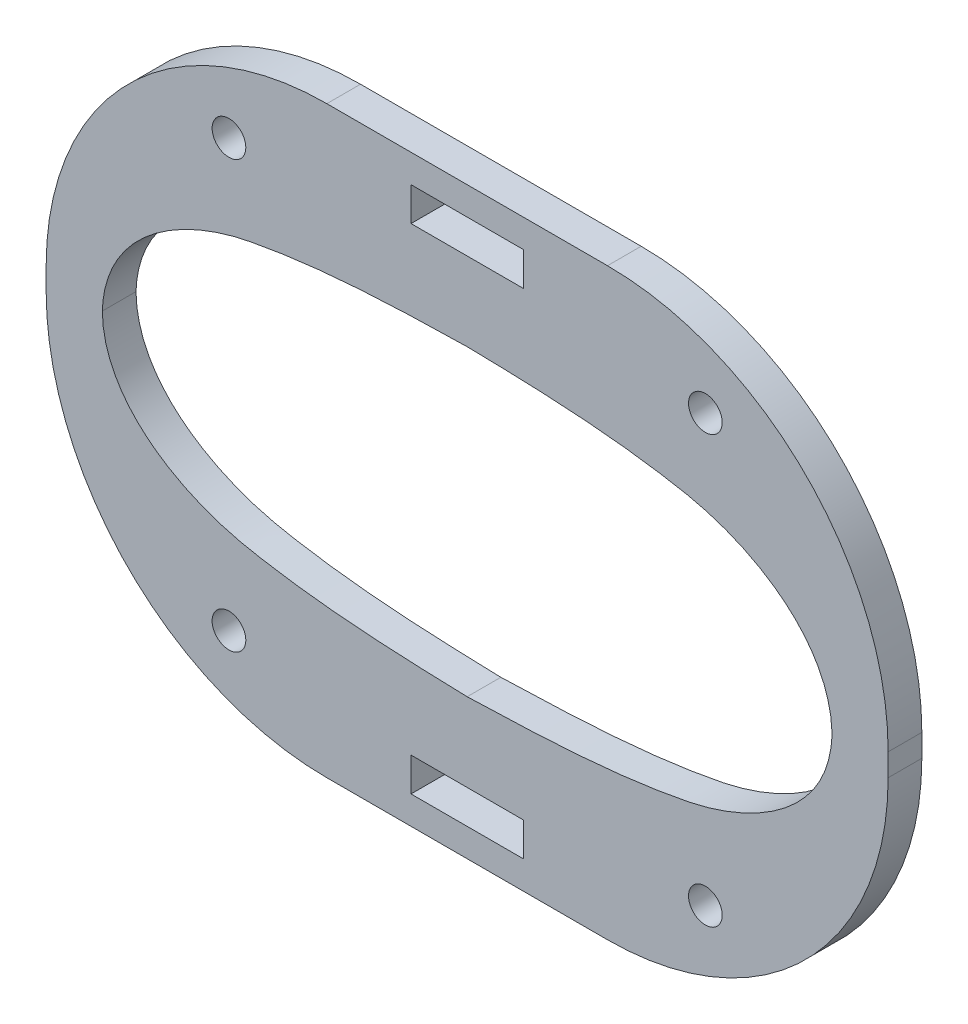
ISO-10303-21;
HEADER;
FILE_DESCRIPTION(('STEP AP214'),'2;1');
FILE_NAME('part.step','',(''),(''),'','','');
FILE_SCHEMA(('AUTOMOTIVE_DESIGN { 1 0 10303 214 1 1 1 1 }'));
ENDSEC;
DATA;
#1=APPLICATION_CONTEXT('core data for automotive mechanical design processes');
#2=APPLICATION_PROTOCOL_DEFINITION('international standard','automotive_design',2000,#1);
#3=PRODUCT_CONTEXT('',#1,'mechanical');
#4=PRODUCT('Part','Part','',(#3));
#5=PRODUCT_RELATED_PRODUCT_CATEGORY('part','',(#4));
#6=PRODUCT_DEFINITION_FORMATION('','',#4);
#7=PRODUCT_DEFINITION_CONTEXT('part definition',#1,'design');
#8=PRODUCT_DEFINITION('design','',#6,#7);
#9=PRODUCT_DEFINITION_SHAPE('','',#8);
#10=(LENGTH_UNIT() NAMED_UNIT(*) SI_UNIT(.MILLI.,.METRE.));
#11=(NAMED_UNIT(*) PLANE_ANGLE_UNIT() SI_UNIT($,.RADIAN.));
#12=(NAMED_UNIT(*) SI_UNIT($,.STERADIAN.) SOLID_ANGLE_UNIT());
#13=UNCERTAINTY_MEASURE_WITH_UNIT(LENGTH_MEASURE(1.E-05),#10,'distance_accuracy_value','');
#14=(GEOMETRIC_REPRESENTATION_CONTEXT(3) GLOBAL_UNCERTAINTY_ASSIGNED_CONTEXT((#13)) GLOBAL_UNIT_ASSIGNED_CONTEXT((#10,
#11,#12)) REPRESENTATION_CONTEXT('',''));
#15=CARTESIAN_POINT('',(0.,0.,0.));
#16=DIRECTION('',(0.,0.,1.));
#17=DIRECTION('',(1.,0.,0.));
#18=AXIS2_PLACEMENT_3D('',#15,#16,#17);
#19=CARTESIAN_POINT('',(-12.5,-0.999999999999991,3.));
#20=DIRECTION('',(0.,0.,-1.));
#21=DIRECTION('',(-1.,0.,0.));
#22=AXIS2_PLACEMENT_3D('',#19,#20,#21);
#23=PLANE('',#22);
#24=DIRECTION('',(0.,1.,0.));
#25=VECTOR('',#24,1.);
#26=CARTESIAN_POINT('',(5.,23.5,3.));
#27=LINE('',#26,#25);
#28=CARTESIAN_POINT('',(5.,20.5,3.));
#29=VERTEX_POINT('',#28);
#30=CARTESIAN_POINT('',(5.,23.5,3.));
#31=VERTEX_POINT('',#30);
#32=EDGE_CURVE('E497',#29,#31,#27,.T.);
#33=ORIENTED_EDGE('',*,*,#32,.F.);
#34=DIRECTION('',(1.,0.,0.));
#35=VECTOR('',#34,1.);
#36=CARTESIAN_POINT('',(5.,20.5,3.));
#37=LINE('',#36,#35);
#38=CARTESIAN_POINT('',(-5.,20.5,3.));
#39=VERTEX_POINT('',#38);
#40=EDGE_CURVE('E504',#39,#29,#37,.T.);
#41=ORIENTED_EDGE('',*,*,#40,.F.);
#42=DIRECTION('',(0.,-1.,0.));
#43=VECTOR('',#42,1.);
#44=CARTESIAN_POINT('',(-5.,23.5,3.));
#45=LINE('',#44,#43);
#46=CARTESIAN_POINT('',(-5.,23.5,3.));
#47=VERTEX_POINT('',#46);
#48=EDGE_CURVE('E501',#47,#39,#45,.T.);
#49=ORIENTED_EDGE('',*,*,#48,.F.);
#50=DIRECTION('',(-1.,0.,0.));
#51=VECTOR('',#50,1.);
#52=CARTESIAN_POINT('',(5.,23.5,3.));
#53=LINE('',#52,#51);
#54=EDGE_CURVE('E499',#31,#47,#53,.T.);
#55=ORIENTED_EDGE('',*,*,#54,.F.);
#56=EDGE_LOOP('',(#33,#41,#49,#55));
#57=FACE_BOUND('',#56,.T.);
#58=CARTESIAN_POINT('',(-12.5,-0.999999999999991,3.));
#59=DIRECTION('',(0.,0.,1.));
#60=DIRECTION('',(-1.,0.,0.));
#61=AXIS2_PLACEMENT_3D('',#58,#59,#60);
#62=CIRCLE('',#61,25.);
#63=CARTESIAN_POINT('',(-37.5,-0.999999999999985,3.));
#64=VERTEX_POINT('',#63);
#65=CARTESIAN_POINT('',(-12.5,-26.,3.));
#66=VERTEX_POINT('',#65);
#67=EDGE_CURVE('E318',#64,#66,#62,.T.);
#68=ORIENTED_EDGE('',*,*,#67,.T.);
#69=DIRECTION('',(1.,0.,0.));
#70=VECTOR('',#69,1.);
#71=CARTESIAN_POINT('',(12.5,-26.,3.));
#72=LINE('',#71,#70);
#73=CARTESIAN_POINT('',(12.5,-26.,3.));
#74=VERTEX_POINT('',#73);
#75=EDGE_CURVE('E344',#66,#74,#72,.T.);
#76=ORIENTED_EDGE('',*,*,#75,.T.);
#77=CARTESIAN_POINT('',(12.5,-0.999999999999991,3.));
#78=DIRECTION('',(0.,0.,1.));
#79=DIRECTION('',(-1.,0.,0.));
#80=AXIS2_PLACEMENT_3D('',#77,#78,#79);
#81=CIRCLE('',#80,25.);
#82=CARTESIAN_POINT('',(37.5,-0.999999999999988,3.));
#83=VERTEX_POINT('',#82);
#84=EDGE_CURVE('E300',#74,#83,#81,.T.);
#85=ORIENTED_EDGE('',*,*,#84,.T.);
#86=DIRECTION('',(0.,1.,0.));
#87=VECTOR('',#86,1.);
#88=CARTESIAN_POINT('',(37.5,0.999999999999985,3.));
#89=LINE('',#88,#87);
#90=CARTESIAN_POINT('',(37.5,0.999999999999985,3.));
#91=VERTEX_POINT('',#90);
#92=EDGE_CURVE('E337',#83,#91,#89,.T.);
#93=ORIENTED_EDGE('',*,*,#92,.T.);
#94=CARTESIAN_POINT('',(12.5,0.999999999999985,3.));
#95=DIRECTION('',(0.,0.,1.));
#96=DIRECTION('',(-1.,0.,0.));
#97=AXIS2_PLACEMENT_3D('',#94,#95,#96);
#98=CIRCLE('',#97,25.);
#99=CARTESIAN_POINT('',(12.5,26.,3.));
#100=VERTEX_POINT('',#99);
#101=EDGE_CURVE('E340',#91,#100,#98,.T.);
#102=ORIENTED_EDGE('',*,*,#101,.T.);
#103=DIRECTION('',(-1.,0.,0.));
#104=VECTOR('',#103,1.);
#105=CARTESIAN_POINT('',(12.5,26.,3.));
#106=LINE('',#105,#104);
#107=CARTESIAN_POINT('',(-12.5,26.,3.));
#108=VERTEX_POINT('',#107);
#109=EDGE_CURVE('E342',#100,#108,#106,.T.);
#110=ORIENTED_EDGE('',*,*,#109,.T.);
#111=CARTESIAN_POINT('',(-12.5,0.999999999999985,3.));
#112=DIRECTION('',(0.,0.,1.));
#113=DIRECTION('',(1.,0.,0.));
#114=AXIS2_PLACEMENT_3D('',#111,#112,#113);
#115=CIRCLE('',#114,25.);
#116=CARTESIAN_POINT('',(-37.5,0.999999999999988,3.));
#117=VERTEX_POINT('',#116);
#118=EDGE_CURVE('E349',#108,#117,#115,.T.);
#119=ORIENTED_EDGE('',*,*,#118,.T.);
#120=DIRECTION('',(0.,-1.,0.));
#121=VECTOR('',#120,1.);
#122=CARTESIAN_POINT('',(-37.5,0.999999999999985,3.));
#123=LINE('',#122,#121);
#124=EDGE_CURVE('E323',#117,#64,#123,.T.);
#125=ORIENTED_EDGE('',*,*,#124,.T.);
#126=EDGE_LOOP('',(#68,#76,#85,#93,#102,#110,#119,#125));
#127=FACE_BOUND('',#126,.T.);
#128=DIRECTION('',(0.,-1.,0.));
#129=VECTOR('',#128,1.);
#130=CARTESIAN_POINT('',(-5.,-23.5,3.));
#131=LINE('',#130,#129);
#132=CARTESIAN_POINT('',(-5.,-20.5,3.));
#133=VERTEX_POINT('',#132);
#134=CARTESIAN_POINT('',(-5.,-23.5,3.));
#135=VERTEX_POINT('',#134);
#136=EDGE_CURVE('E377',#133,#135,#131,.T.);
#137=ORIENTED_EDGE('',*,*,#136,.F.);
#138=DIRECTION('',(-1.,0.,0.));
#139=VECTOR('',#138,1.);
#140=CARTESIAN_POINT('',(5.,-20.5,3.));
#141=LINE('',#140,#139);
#142=CARTESIAN_POINT('',(5.,-20.5,3.));
#143=VERTEX_POINT('',#142);
#144=EDGE_CURVE('E379',#143,#133,#141,.T.);
#145=ORIENTED_EDGE('',*,*,#144,.F.);
#146=DIRECTION('',(0.,1.,0.));
#147=VECTOR('',#146,1.);
#148=CARTESIAN_POINT('',(5.,-23.5,3.));
#149=LINE('',#148,#147);
#150=CARTESIAN_POINT('',(5.,-23.5,3.));
#151=VERTEX_POINT('',#150);
#152=EDGE_CURVE('E384',#151,#143,#149,.T.);
#153=ORIENTED_EDGE('',*,*,#152,.F.);
#154=DIRECTION('',(1.,0.,0.));
#155=VECTOR('',#154,1.);
#156=CARTESIAN_POINT('',(5.,-23.5,3.));
#157=LINE('',#156,#155);
#158=EDGE_CURVE('E380',#135,#151,#157,.T.);
#159=ORIENTED_EDGE('',*,*,#158,.F.);
#160=EDGE_LOOP('',(#137,#145,#153,#159));
#161=FACE_BOUND('',#160,.T.);
#162=CARTESIAN_POINT('',(32.5,0.,3.));
#163=CARTESIAN_POINT('',(32.2789697047507,6.55700643689235,3.));
#164=CARTESIAN_POINT('',(25.8414124332181,10.6704681508911,3.));
#165=CARTESIAN_POINT('',(13.0615502468426,13.1594938554552,3.));
#166=CARTESIAN_POINT('',(6.51431395357622,13.3717029242539,3.));
#167=CARTESIAN_POINT('',(0.,13.5,3.));
#168=B_SPLINE_CURVE_WITH_KNOTS('',3,(#162,#163,#164,#165,#166,#167),.UNSPECIFIED.,.F.,.F.,(4,2,
4),(0.,0.5,1.),.UNSPECIFIED.);
#169=CARTESIAN_POINT('',(32.5,0.,3.));
#170=VERTEX_POINT('',#169);
#171=CARTESIAN_POINT('',(0.,13.5,3.));
#172=VERTEX_POINT('',#171);
#173=EDGE_CURVE('E170',#170,#172,#168,.T.);
#174=ORIENTED_EDGE('',*,*,#173,.F.);
#175=CARTESIAN_POINT('',(0.,-13.5,3.));
#176=CARTESIAN_POINT('',(6.51564435078907,-13.3087127957997,3.));
#177=CARTESIAN_POINT('',(13.0549194035547,-13.0524756208517,3.));
#178=CARTESIAN_POINT('',(25.8514525408866,-10.5601606196743,3.));
#179=CARTESIAN_POINT('',(32.4272577330712,-6.54783669185813,3.));
#180=CARTESIAN_POINT('',(32.5,0.,3.));
#181=B_SPLINE_CURVE_WITH_KNOTS('',3,(#175,#176,#177,#178,#179,#180),.UNSPECIFIED.,.F.,.F.,(4,2,
4),(0.,0.5,1.),.UNSPECIFIED.);
#182=CARTESIAN_POINT('',(0.,-13.5,3.));
#183=VERTEX_POINT('',#182);
#184=EDGE_CURVE('E193',#183,#170,#181,.T.);
#185=ORIENTED_EDGE('',*,*,#184,.F.);
#186=CARTESIAN_POINT('',(-32.5,0.,3.));
#187=CARTESIAN_POINT('',(-32.4272577330711,-6.54783669185816,3.));
#188=CARTESIAN_POINT('',(-25.8514525408867,-10.5601606196743,3.));
#189=CARTESIAN_POINT('',(-13.0549194035547,-13.0524756208517,3.));
#190=CARTESIAN_POINT('',(-6.51564435078911,-13.3087127957997,3.));
#191=CARTESIAN_POINT('',(0.,-13.5,3.));
#192=B_SPLINE_CURVE_WITH_KNOTS('',3,(#186,#187,#188,#189,#190,#191),.UNSPECIFIED.,.F.,.F.,(4,2,
4),(0.,0.5,1.),.UNSPECIFIED.);
#193=CARTESIAN_POINT('',(-32.5,0.,3.));
#194=VERTEX_POINT('',#193);
#195=EDGE_CURVE('E191',#194,#183,#192,.T.);
#196=ORIENTED_EDGE('',*,*,#195,.F.);
#197=CARTESIAN_POINT('',(0.,13.5,3.));
#198=CARTESIAN_POINT('',(-6.51431395357621,13.3717029242539,3.));
#199=CARTESIAN_POINT('',(-13.0615502468426,13.1594938554551,3.));
#200=CARTESIAN_POINT('',(-25.8414124332181,10.6704681508911,3.));
#201=CARTESIAN_POINT('',(-32.2789697047506,6.55700643689235,3.));
#202=CARTESIAN_POINT('',(-32.5,0.,3.));
#203=B_SPLINE_CURVE_WITH_KNOTS('',3,(#197,#198,#199,#200,#201,#202),.UNSPECIFIED.,.F.,.F.,(4,2,
4),(0.,0.5,1.),.UNSPECIFIED.);
#204=EDGE_CURVE('E178',#172,#194,#203,.T.);
#205=ORIENTED_EDGE('',*,*,#204,.F.);
#206=EDGE_LOOP('',(#174,#185,#196,#205));
#207=FACE_BOUND('',#206,.T.);
#208=CARTESIAN_POINT('',(21.2177978870814,-19.,3.));
#209=DIRECTION('',(0.,0.,1.));
#210=DIRECTION('',(1.,0.,0.));
#211=AXIS2_PLACEMENT_3D('',#208,#209,#210);
#212=CIRCLE('',#211,1.5);
#213=CARTESIAN_POINT('',(22.7177978870814,-19.,3.));
#214=VERTEX_POINT('',#213);
#215=EDGE_CURVE('E442',#214,#214,#212,.T.);
#216=ORIENTED_EDGE('',*,*,#215,.F.);
#217=EDGE_LOOP('',(#216));
#218=FACE_BOUND('',#217,.T.);
#219=CARTESIAN_POINT('',(-21.2177978870814,-19.,3.));
#220=DIRECTION('',(0.,0.,1.));
#221=DIRECTION('',(-1.,0.,0.));
#222=AXIS2_PLACEMENT_3D('',#219,#220,#221);
#223=CIRCLE('',#222,1.5);
#224=CARTESIAN_POINT('',(-22.7177978870814,-19.,3.));
#225=VERTEX_POINT('',#224);
#226=EDGE_CURVE('E437',#225,#225,#223,.T.);
#227=ORIENTED_EDGE('',*,*,#226,.F.);
#228=EDGE_LOOP('',(#227));
#229=FACE_BOUND('',#228,.T.);
#230=CARTESIAN_POINT('',(21.2177978870813,19.,3.));
#231=DIRECTION('',(0.,0.,1.));
#232=DIRECTION('',(-1.,0.,0.));
#233=AXIS2_PLACEMENT_3D('',#230,#231,#232);
#234=CIRCLE('',#233,1.5);
#235=CARTESIAN_POINT('',(19.7177978870813,19.,3.));
#236=VERTEX_POINT('',#235);
#237=EDGE_CURVE('E432',#236,#236,#234,.T.);
#238=ORIENTED_EDGE('',*,*,#237,.F.);
#239=EDGE_LOOP('',(#238));
#240=FACE_BOUND('',#239,.T.);
#241=CARTESIAN_POINT('',(-21.2177978870814,19.,3.));
#242=DIRECTION('',(0.,0.,1.));
#243=DIRECTION('',(1.,0.,0.));
#244=AXIS2_PLACEMENT_3D('',#241,#242,#243);
#245=CIRCLE('',#244,1.5);
#246=CARTESIAN_POINT('',(-19.7177978870814,19.,3.));
#247=VERTEX_POINT('',#246);
#248=EDGE_CURVE('E426',#247,#247,#245,.T.);
#249=ORIENTED_EDGE('',*,*,#248,.F.);
#250=EDGE_LOOP('',(#249));
#251=FACE_BOUND('',#250,.T.);
#252=ADVANCED_FACE('F33',(#57,#127,#161,#207,#218,#229,#240,#251),#23,.F.);
#253=CARTESIAN_POINT('',(-12.5,-0.999999999999991,0.));
#254=DIRECTION('',(0.,0.,-1.));
#255=DIRECTION('',(-1.,0.,0.));
#256=AXIS2_PLACEMENT_3D('',#253,#254,#255);
#257=PLANE('',#256);
#258=CARTESIAN_POINT('',(21.2177978870813,19.,0.));
#259=DIRECTION('',(0.,0.,1.));
#260=DIRECTION('',(-1.,0.,0.));
#261=AXIS2_PLACEMENT_3D('',#258,#259,#260);
#262=CIRCLE('',#261,1.5);
#263=CARTESIAN_POINT('',(19.7177978870813,19.,0.));
#264=VERTEX_POINT('',#263);
#265=EDGE_CURVE('E429',#264,#264,#262,.T.);
#266=ORIENTED_EDGE('',*,*,#265,.T.);
#267=EDGE_LOOP('',(#266));
#268=FACE_BOUND('',#267,.T.);
#269=CARTESIAN_POINT('',(21.2177978870814,-19.,0.));
#270=DIRECTION('',(0.,0.,1.));
#271=DIRECTION('',(1.,0.,0.));
#272=AXIS2_PLACEMENT_3D('',#269,#270,#271);
#273=CIRCLE('',#272,1.5);
#274=CARTESIAN_POINT('',(22.7177978870814,-19.,0.));
#275=VERTEX_POINT('',#274);
#276=EDGE_CURVE('E440',#275,#275,#273,.T.);
#277=ORIENTED_EDGE('',*,*,#276,.T.);
#278=EDGE_LOOP('',(#277));
#279=FACE_BOUND('',#278,.T.);
#280=CARTESIAN_POINT('',(-12.5,-0.999999999999991,0.));
#281=DIRECTION('',(0.,0.,1.));
#282=DIRECTION('',(-1.,0.,0.));
#283=AXIS2_PLACEMENT_3D('',#280,#281,#282);
#284=CIRCLE('',#283,25.);
#285=CARTESIAN_POINT('',(-37.5,-0.999999999999985,0.));
#286=VERTEX_POINT('',#285);
#287=CARTESIAN_POINT('',(-12.5,-26.,0.));
#288=VERTEX_POINT('',#287);
#289=EDGE_CURVE('E296',#286,#288,#284,.T.);
#290=ORIENTED_EDGE('',*,*,#289,.F.);
#291=DIRECTION('',(0.,-1.,0.));
#292=VECTOR('',#291,1.);
#293=CARTESIAN_POINT('',(-37.5,0.999999999999985,0.));
#294=LINE('',#293,#292);
#295=CARTESIAN_POINT('',(-37.5,0.999999999999988,0.));
#296=VERTEX_POINT('',#295);
#297=EDGE_CURVE('E316',#296,#286,#294,.T.);
#298=ORIENTED_EDGE('',*,*,#297,.F.);
#299=CARTESIAN_POINT('',(-12.5,0.999999999999985,0.));
#300=DIRECTION('',(0.,0.,1.));
#301=DIRECTION('',(1.,0.,0.));
#302=AXIS2_PLACEMENT_3D('',#299,#300,#301);
#303=CIRCLE('',#302,25.);
#304=CARTESIAN_POINT('',(-12.5,26.,0.));
#305=VERTEX_POINT('',#304);
#306=EDGE_CURVE('E314',#305,#296,#303,.T.);
#307=ORIENTED_EDGE('',*,*,#306,.F.);
#308=DIRECTION('',(-1.,0.,0.));
#309=VECTOR('',#308,1.);
#310=CARTESIAN_POINT('',(12.5,26.,0.));
#311=LINE('',#310,#309);
#312=CARTESIAN_POINT('',(12.5,26.,0.));
#313=VERTEX_POINT('',#312);
#314=EDGE_CURVE('E312',#313,#305,#311,.T.);
#315=ORIENTED_EDGE('',*,*,#314,.F.);
#316=CARTESIAN_POINT('',(12.5,0.999999999999985,0.));
#317=DIRECTION('',(0.,0.,1.));
#318=DIRECTION('',(-1.,0.,0.));
#319=AXIS2_PLACEMENT_3D('',#316,#317,#318);
#320=CIRCLE('',#319,25.);
#321=CARTESIAN_POINT('',(37.5,0.999999999999985,0.));
#322=VERTEX_POINT('',#321);
#323=EDGE_CURVE('E307',#322,#313,#320,.T.);
#324=ORIENTED_EDGE('',*,*,#323,.F.);
#325=DIRECTION('',(0.,1.,0.));
#326=VECTOR('',#325,1.);
#327=CARTESIAN_POINT('',(37.5,0.999999999999985,0.));
#328=LINE('',#327,#326);
#329=CARTESIAN_POINT('',(37.5,-0.999999999999988,0.));
#330=VERTEX_POINT('',#329);
#331=EDGE_CURVE('E305',#330,#322,#328,.T.);
#332=ORIENTED_EDGE('',*,*,#331,.F.);
#333=CARTESIAN_POINT('',(12.5,-0.999999999999991,0.));
#334=DIRECTION('',(0.,0.,1.));
#335=DIRECTION('',(-1.,0.,0.));
#336=AXIS2_PLACEMENT_3D('',#333,#334,#335);
#337=CIRCLE('',#336,25.);
#338=CARTESIAN_POINT('',(12.5,-26.,0.));
#339=VERTEX_POINT('',#338);
#340=EDGE_CURVE('E295',#339,#330,#337,.T.);
#341=ORIENTED_EDGE('',*,*,#340,.F.);
#342=DIRECTION('',(1.,0.,0.));
#343=VECTOR('',#342,1.);
#344=CARTESIAN_POINT('',(12.5,-26.,0.));
#345=LINE('',#344,#343);
#346=EDGE_CURVE('E287',#288,#339,#345,.T.);
#347=ORIENTED_EDGE('',*,*,#346,.F.);
#348=EDGE_LOOP('',(#290,#298,#307,#315,#324,#332,#341,#347));
#349=FACE_BOUND('',#348,.T.);
#350=DIRECTION('',(-1.,0.,0.));
#351=VECTOR('',#350,1.);
#352=CARTESIAN_POINT('',(5.,-20.5,0.));
#353=LINE('',#352,#351);
#354=CARTESIAN_POINT('',(5.,-20.5,0.));
#355=VERTEX_POINT('',#354);
#356=CARTESIAN_POINT('',(-5.,-20.5,0.));
#357=VERTEX_POINT('',#356);
#358=EDGE_CURVE('E382',#355,#357,#353,.T.);
#359=ORIENTED_EDGE('',*,*,#358,.T.);
#360=DIRECTION('',(0.,-1.,0.));
#361=VECTOR('',#360,1.);
#362=CARTESIAN_POINT('',(-5.,-23.5,0.));
#363=LINE('',#362,#361);
#364=CARTESIAN_POINT('',(-5.,-23.5,0.));
#365=VERTEX_POINT('',#364);
#366=EDGE_CURVE('E397',#357,#365,#363,.T.);
#367=ORIENTED_EDGE('',*,*,#366,.T.);
#368=DIRECTION('',(1.,0.,0.));
#369=VECTOR('',#368,1.);
#370=CARTESIAN_POINT('',(5.,-23.5,0.));
#371=LINE('',#370,#369);
#372=CARTESIAN_POINT('',(5.,-23.5,0.));
#373=VERTEX_POINT('',#372);
#374=EDGE_CURVE('E399',#365,#373,#371,.T.);
#375=ORIENTED_EDGE('',*,*,#374,.T.);
#376=DIRECTION('',(0.,1.,0.));
#377=VECTOR('',#376,1.);
#378=CARTESIAN_POINT('',(5.,-23.5,0.));
#379=LINE('',#378,#377);
#380=EDGE_CURVE('E387',#373,#355,#379,.T.);
#381=ORIENTED_EDGE('',*,*,#380,.T.);
#382=EDGE_LOOP('',(#359,#367,#375,#381));
#383=FACE_BOUND('',#382,.T.);
#384=DIRECTION('',(1.,0.,0.));
#385=VECTOR('',#384,1.);
#386=CARTESIAN_POINT('',(5.,20.5,0.));
#387=LINE('',#386,#385);
#388=CARTESIAN_POINT('',(-5.,20.5,0.));
#389=VERTEX_POINT('',#388);
#390=CARTESIAN_POINT('',(5.,20.5,0.));
#391=VERTEX_POINT('',#390);
#392=EDGE_CURVE('E414',#389,#391,#387,.T.);
#393=ORIENTED_EDGE('',*,*,#392,.T.);
#394=DIRECTION('',(0.,1.,0.));
#395=VECTOR('',#394,1.);
#396=CARTESIAN_POINT('',(5.,23.5,0.));
#397=LINE('',#396,#395);
#398=CARTESIAN_POINT('',(5.,23.5,0.));
#399=VERTEX_POINT('',#398);
#400=EDGE_CURVE('E186',#391,#399,#397,.T.);
#401=ORIENTED_EDGE('',*,*,#400,.T.);
#402=DIRECTION('',(-1.,0.,0.));
#403=VECTOR('',#402,1.);
#404=CARTESIAN_POINT('',(5.,23.5,0.));
#405=LINE('',#404,#403);
#406=CARTESIAN_POINT('',(-5.,23.5,0.));
#407=VERTEX_POINT('',#406);
#408=EDGE_CURVE('E508',#399,#407,#405,.T.);
#409=ORIENTED_EDGE('',*,*,#408,.T.);
#410=DIRECTION('',(0.,-1.,0.));
#411=VECTOR('',#410,1.);
#412=CARTESIAN_POINT('',(-5.,23.5,0.));
#413=LINE('',#412,#411);
#414=EDGE_CURVE('E511',#407,#389,#413,.T.);
#415=ORIENTED_EDGE('',*,*,#414,.T.);
#416=EDGE_LOOP('',(#393,#401,#409,#415));
#417=FACE_BOUND('',#416,.T.);
#418=CARTESIAN_POINT('',(0.,-13.5,0.));
#419=CARTESIAN_POINT('',(6.51564435078907,-13.3087127957997,0.));
#420=CARTESIAN_POINT('',(13.0549194035547,-13.0524756208517,0.));
#421=CARTESIAN_POINT('',(25.8514525408866,-10.5601606196743,0.));
#422=CARTESIAN_POINT('',(32.4272577330712,-6.54783669185813,0.));
#423=CARTESIAN_POINT('',(32.5,0.,0.));
#424=B_SPLINE_CURVE_WITH_KNOTS('',3,(#418,#419,#420,#421,#422,#423),.UNSPECIFIED.,.F.,.F.,(4,2,
4),(0.,0.5,1.),.UNSPECIFIED.);
#425=CARTESIAN_POINT('',(0.,-13.5,0.));
#426=VERTEX_POINT('',#425);
#427=CARTESIAN_POINT('',(32.5,0.,0.));
#428=VERTEX_POINT('',#427);
#429=EDGE_CURVE('E179',#426,#428,#424,.T.);
#430=ORIENTED_EDGE('',*,*,#429,.T.);
#431=CARTESIAN_POINT('',(32.5,0.,0.));
#432=CARTESIAN_POINT('',(32.2789697047507,6.55700643689235,0.));
#433=CARTESIAN_POINT('',(25.8414124332181,10.6704681508911,0.));
#434=CARTESIAN_POINT('',(13.0615502468426,13.1594938554552,0.));
#435=CARTESIAN_POINT('',(6.51431395357622,13.3717029242539,0.));
#436=CARTESIAN_POINT('',(0.,13.5,0.));
#437=B_SPLINE_CURVE_WITH_KNOTS('',3,(#431,#432,#433,#434,#435,#436),.UNSPECIFIED.,.F.,.F.,(4,2,
4),(0.,0.5,1.),.UNSPECIFIED.);
#438=CARTESIAN_POINT('',(0.,13.5,0.));
#439=VERTEX_POINT('',#438);
#440=EDGE_CURVE('E56',#428,#439,#437,.T.);
#441=ORIENTED_EDGE('',*,*,#440,.T.);
#442=CARTESIAN_POINT('',(0.,13.5,0.));
#443=CARTESIAN_POINT('',(-6.51431395357621,13.3717029242539,0.));
#444=CARTESIAN_POINT('',(-13.0615502468426,13.1594938554551,0.));
#445=CARTESIAN_POINT('',(-25.8414124332181,10.6704681508911,0.));
#446=CARTESIAN_POINT('',(-32.2789697047506,6.55700643689235,0.));
#447=CARTESIAN_POINT('',(-32.5,0.,0.));
#448=B_SPLINE_CURVE_WITH_KNOTS('',3,(#442,#443,#444,#445,#446,#447),.UNSPECIFIED.,.F.,.F.,(4,2,
4),(0.,0.5,1.),.UNSPECIFIED.);
#449=CARTESIAN_POINT('',(-32.5,0.,0.));
#450=VERTEX_POINT('',#449);
#451=EDGE_CURVE('E185',#439,#450,#448,.T.);
#452=ORIENTED_EDGE('',*,*,#451,.T.);
#453=CARTESIAN_POINT('',(-32.5,0.,0.));
#454=CARTESIAN_POINT('',(-32.4272577330711,-6.54783669185816,0.));
#455=CARTESIAN_POINT('',(-25.8514525408867,-10.5601606196743,0.));
#456=CARTESIAN_POINT('',(-13.0549194035547,-13.0524756208517,0.));
#457=CARTESIAN_POINT('',(-6.51564435078911,-13.3087127957997,0.));
#458=CARTESIAN_POINT('',(0.,-13.5,0.));
#459=B_SPLINE_CURVE_WITH_KNOTS('',3,(#453,#454,#455,#456,#457,#458),.UNSPECIFIED.,.F.,.F.,(4,2,
4),(0.,0.5,1.),.UNSPECIFIED.);
#460=EDGE_CURVE('E478',#450,#426,#459,.T.);
#461=ORIENTED_EDGE('',*,*,#460,.T.);
#462=EDGE_LOOP('',(#430,#441,#452,#461));
#463=FACE_BOUND('',#462,.T.);
#464=CARTESIAN_POINT('',(-21.2177978870814,-19.,0.));
#465=DIRECTION('',(0.,0.,1.));
#466=DIRECTION('',(-1.,0.,0.));
#467=AXIS2_PLACEMENT_3D('',#464,#465,#466);
#468=CIRCLE('',#467,1.5);
#469=CARTESIAN_POINT('',(-22.7177978870814,-19.,0.));
#470=VERTEX_POINT('',#469);
#471=EDGE_CURVE('E421',#470,#470,#468,.T.);
#472=ORIENTED_EDGE('',*,*,#471,.T.);
#473=EDGE_LOOP('',(#472));
#474=FACE_BOUND('',#473,.T.);
#475=CARTESIAN_POINT('',(-21.2177978870814,19.,0.));
#476=DIRECTION('',(0.,0.,1.));
#477=DIRECTION('',(1.,0.,0.));
#478=AXIS2_PLACEMENT_3D('',#475,#476,#477);
#479=CIRCLE('',#478,1.5);
#480=CARTESIAN_POINT('',(-19.7177978870814,19.,0.));
#481=VERTEX_POINT('',#480);
#482=EDGE_CURVE('E424',#481,#481,#479,.T.);
#483=ORIENTED_EDGE('',*,*,#482,.T.);
#484=EDGE_LOOP('',(#483));
#485=FACE_BOUND('',#484,.T.);
#486=ADVANCED_FACE('F252',(#268,#279,#349,#383,#417,#463,#474,#485),#257,.T.);
#487=CARTESIAN_POINT('',(-12.5,-0.999999999999991,3.));
#488=DIRECTION('',(0.,0.,-1.));
#489=DIRECTION('',(-1.,0.,0.));
#490=AXIS2_PLACEMENT_3D('',#487,#488,#489);
#491=CYLINDRICAL_SURFACE('',#490,25.);
#492=ORIENTED_EDGE('',*,*,#289,.T.);
#493=DIRECTION('',(0.,0.,-1.));
#494=VECTOR('',#493,1.);
#495=CARTESIAN_POINT('',(-12.5,-26.,3.));
#496=LINE('',#495,#494);
#497=EDGE_CURVE('E11',#66,#288,#496,.T.);
#498=ORIENTED_EDGE('',*,*,#497,.F.);
#499=ORIENTED_EDGE('',*,*,#67,.F.);
#500=DIRECTION('',(0.,0.,-1.));
#501=VECTOR('',#500,1.);
#502=CARTESIAN_POINT('',(-37.5,-0.999999999999985,3.));
#503=LINE('',#502,#501);
#504=EDGE_CURVE('E319',#64,#286,#503,.T.);
#505=ORIENTED_EDGE('',*,*,#504,.T.);
#506=EDGE_LOOP('',(#492,#498,#499,#505));
#507=FACE_BOUND('',#506,.T.);
#508=ADVANCED_FACE('F35',(#507),#491,.T.);
#509=CARTESIAN_POINT('',(12.5,-26.,3.));
#510=DIRECTION('',(0.,1.,0.));
#511=DIRECTION('',(-1.,0.,0.));
#512=AXIS2_PLACEMENT_3D('',#509,#510,#511);
#513=PLANE('',#512);
#514=ORIENTED_EDGE('',*,*,#346,.T.);
#515=DIRECTION('',(0.,0.,-1.));
#516=VECTOR('',#515,1.);
#517=CARTESIAN_POINT('',(12.5,-26.,3.));
#518=LINE('',#517,#516);
#519=EDGE_CURVE('E41',#74,#339,#518,.T.);
#520=ORIENTED_EDGE('',*,*,#519,.F.);
#521=ORIENTED_EDGE('',*,*,#75,.F.);
#522=ORIENTED_EDGE('',*,*,#497,.T.);
#523=EDGE_LOOP('',(#514,#520,#521,#522));
#524=FACE_BOUND('',#523,.T.);
#525=ADVANCED_FACE('F278',(#524),#513,.F.);
#526=CARTESIAN_POINT('',(12.5,-0.999999999999991,3.));
#527=DIRECTION('',(0.,0.,-1.));
#528=DIRECTION('',(-1.,0.,0.));
#529=AXIS2_PLACEMENT_3D('',#526,#527,#528);
#530=CYLINDRICAL_SURFACE('',#529,25.);
#531=ORIENTED_EDGE('',*,*,#340,.T.);
#532=DIRECTION('',(0.,0.,-1.));
#533=VECTOR('',#532,1.);
#534=CARTESIAN_POINT('',(37.5,-0.999999999999988,3.));
#535=LINE('',#534,#533);
#536=EDGE_CURVE('E301',#83,#330,#535,.T.);
#537=ORIENTED_EDGE('',*,*,#536,.F.);
#538=ORIENTED_EDGE('',*,*,#84,.F.);
#539=ORIENTED_EDGE('',*,*,#519,.T.);
#540=EDGE_LOOP('',(#531,#537,#538,#539));
#541=FACE_BOUND('',#540,.T.);
#542=ADVANCED_FACE('F275',(#541),#530,.T.);
#543=CARTESIAN_POINT('',(37.5,0.999999999999985,3.));
#544=DIRECTION('',(-1.,0.,0.));
#545=DIRECTION('',(0.,0.,1.));
#546=AXIS2_PLACEMENT_3D('',#543,#544,#545);
#547=PLANE('',#546);
#548=ORIENTED_EDGE('',*,*,#331,.T.);
#549=DIRECTION('',(0.,0.,-1.));
#550=VECTOR('',#549,1.);
#551=CARTESIAN_POINT('',(37.5,0.999999999999985,3.));
#552=LINE('',#551,#550);
#553=EDGE_CURVE('E332',#91,#322,#552,.T.);
#554=ORIENTED_EDGE('',*,*,#553,.F.);
#555=ORIENTED_EDGE('',*,*,#92,.F.);
#556=ORIENTED_EDGE('',*,*,#536,.T.);
#557=EDGE_LOOP('',(#548,#554,#555,#556));
#558=FACE_BOUND('',#557,.T.);
#559=ADVANCED_FACE('F271',(#558),#547,.F.);
#560=CARTESIAN_POINT('',(12.5,0.999999999999985,3.));
#561=DIRECTION('',(0.,0.,-1.));
#562=DIRECTION('',(-1.,0.,0.));
#563=AXIS2_PLACEMENT_3D('',#560,#561,#562);
#564=CYLINDRICAL_SURFACE('',#563,25.);
#565=ORIENTED_EDGE('',*,*,#323,.T.);
#566=DIRECTION('',(0.,0.,-1.));
#567=VECTOR('',#566,1.);
#568=CARTESIAN_POINT('',(12.5,26.,3.));
#569=LINE('',#568,#567);
#570=EDGE_CURVE('E329',#100,#313,#569,.T.);
#571=ORIENTED_EDGE('',*,*,#570,.F.);
#572=ORIENTED_EDGE('',*,*,#101,.F.);
#573=ORIENTED_EDGE('',*,*,#553,.T.);
#574=EDGE_LOOP('',(#565,#571,#572,#573));
#575=FACE_BOUND('',#574,.T.);
#576=ADVANCED_FACE('F267',(#575),#564,.T.);
#577=CARTESIAN_POINT('',(12.5,26.,3.));
#578=DIRECTION('',(0.,-1.,0.));
#579=DIRECTION('',(0.,0.,-1.));
#580=AXIS2_PLACEMENT_3D('',#577,#578,#579);
#581=PLANE('',#580);
#582=ORIENTED_EDGE('',*,*,#314,.T.);
#583=DIRECTION('',(0.,0.,-1.));
#584=VECTOR('',#583,1.);
#585=CARTESIAN_POINT('',(-12.5,26.,3.));
#586=LINE('',#585,#584);
#587=EDGE_CURVE('E326',#108,#305,#586,.T.);
#588=ORIENTED_EDGE('',*,*,#587,.F.);
#589=ORIENTED_EDGE('',*,*,#109,.F.);
#590=ORIENTED_EDGE('',*,*,#570,.T.);
#591=EDGE_LOOP('',(#582,#588,#589,#590));
#592=FACE_BOUND('',#591,.T.);
#593=ADVANCED_FACE('F263',(#592),#581,.F.);
#594=CARTESIAN_POINT('',(-12.5,0.999999999999985,3.));
#595=DIRECTION('',(0.,0.,-1.));
#596=DIRECTION('',(-1.,0.,0.));
#597=AXIS2_PLACEMENT_3D('',#594,#595,#596);
#598=CYLINDRICAL_SURFACE('',#597,25.);
#599=ORIENTED_EDGE('',*,*,#306,.T.);
#600=DIRECTION('',(0.,0.,-1.));
#601=VECTOR('',#600,1.);
#602=CARTESIAN_POINT('',(-37.5,0.999999999999988,3.));
#603=LINE('',#602,#601);
#604=EDGE_CURVE('E322',#117,#296,#603,.T.);
#605=ORIENTED_EDGE('',*,*,#604,.F.);
#606=ORIENTED_EDGE('',*,*,#118,.F.);
#607=ORIENTED_EDGE('',*,*,#587,.T.);
#608=EDGE_LOOP('',(#599,#605,#606,#607));
#609=FACE_BOUND('',#608,.T.);
#610=ADVANCED_FACE('F259',(#609),#598,.T.);
#611=CARTESIAN_POINT('',(-37.5,0.999999999999985,3.));
#612=DIRECTION('',(1.,0.,0.));
#613=DIRECTION('',(0.,0.,-1.));
#614=AXIS2_PLACEMENT_3D('',#611,#612,#613);
#615=PLANE('',#614);
#616=ORIENTED_EDGE('',*,*,#297,.T.);
#617=ORIENTED_EDGE('',*,*,#504,.F.);
#618=ORIENTED_EDGE('',*,*,#124,.F.);
#619=ORIENTED_EDGE('',*,*,#604,.T.);
#620=EDGE_LOOP('',(#616,#617,#618,#619));
#621=FACE_BOUND('',#620,.T.);
#622=ADVANCED_FACE('F248',(#621),#615,.F.);
#623=CARTESIAN_POINT('',(-5.,-23.5,3.));
#624=DIRECTION('',(1.,0.,0.));
#625=DIRECTION('',(0.,0.,-1.));
#626=AXIS2_PLACEMENT_3D('',#623,#624,#625);
#627=PLANE('',#626);
#628=ORIENTED_EDGE('',*,*,#366,.F.);
#629=DIRECTION('',(0.,0.,-1.));
#630=VECTOR('',#629,1.);
#631=CARTESIAN_POINT('',(-5.,-20.5,3.));
#632=LINE('',#631,#630);
#633=EDGE_CURVE('E396',#133,#357,#632,.T.);
#634=ORIENTED_EDGE('',*,*,#633,.F.);
#635=ORIENTED_EDGE('',*,*,#136,.T.);
#636=DIRECTION('',(0.,0.,-1.));
#637=VECTOR('',#636,1.);
#638=CARTESIAN_POINT('',(-5.,-23.5,3.));
#639=LINE('',#638,#637);
#640=EDGE_CURVE('E351',#135,#365,#639,.T.);
#641=ORIENTED_EDGE('',*,*,#640,.T.);
#642=EDGE_LOOP('',(#628,#634,#635,#641));
#643=FACE_BOUND('',#642,.T.);
#644=ADVANCED_FACE('F244',(#643),#627,.T.);
#645=CARTESIAN_POINT('',(5.,-23.5,3.));
#646=DIRECTION('',(0.,1.,0.));
#647=DIRECTION('',(-1.,0.,0.));
#648=AXIS2_PLACEMENT_3D('',#645,#646,#647);
#649=PLANE('',#648);
#650=ORIENTED_EDGE('',*,*,#374,.F.);
#651=ORIENTED_EDGE('',*,*,#640,.F.);
#652=ORIENTED_EDGE('',*,*,#158,.T.);
#653=DIRECTION('',(0.,0.,-1.));
#654=VECTOR('',#653,1.);
#655=CARTESIAN_POINT('',(5.,-23.5,3.));
#656=LINE('',#655,#654);
#657=EDGE_CURVE('E353',#151,#373,#656,.T.);
#658=ORIENTED_EDGE('',*,*,#657,.T.);
#659=EDGE_LOOP('',(#650,#651,#652,#658));
#660=FACE_BOUND('',#659,.T.);
#661=ADVANCED_FACE('F240',(#660),#649,.T.);
#662=CARTESIAN_POINT('',(5.,-23.5,3.));
#663=DIRECTION('',(-1.,0.,0.));
#664=DIRECTION('',(0.,0.,1.));
#665=AXIS2_PLACEMENT_3D('',#662,#663,#664);
#666=PLANE('',#665);
#667=ORIENTED_EDGE('',*,*,#380,.F.);
#668=ORIENTED_EDGE('',*,*,#657,.F.);
#669=ORIENTED_EDGE('',*,*,#152,.T.);
#670=DIRECTION('',(0.,0.,-1.));
#671=VECTOR('',#670,1.);
#672=CARTESIAN_POINT('',(5.,-20.5,3.));
#673=LINE('',#672,#671);
#674=EDGE_CURVE('E357',#143,#355,#673,.T.);
#675=ORIENTED_EDGE('',*,*,#674,.T.);
#676=EDGE_LOOP('',(#667,#668,#669,#675));
#677=FACE_BOUND('',#676,.T.);
#678=ADVANCED_FACE('F236',(#677),#666,.T.);
#679=CARTESIAN_POINT('',(5.,-20.5,3.));
#680=DIRECTION('',(0.,-1.,0.));
#681=DIRECTION('',(0.,0.,-1.));
#682=AXIS2_PLACEMENT_3D('',#679,#680,#681);
#683=PLANE('',#682);
#684=ORIENTED_EDGE('',*,*,#358,.F.);
#685=ORIENTED_EDGE('',*,*,#674,.F.);
#686=ORIENTED_EDGE('',*,*,#144,.T.);
#687=ORIENTED_EDGE('',*,*,#633,.T.);
#688=EDGE_LOOP('',(#684,#685,#686,#687));
#689=FACE_BOUND('',#688,.T.);
#690=ADVANCED_FACE('F232',(#689),#683,.T.);
#691=CARTESIAN_POINT('',(5.,23.5,3.));
#692=DIRECTION('',(-1.,0.,0.));
#693=DIRECTION('',(0.,-1.,0.));
#694=AXIS2_PLACEMENT_3D('',#691,#692,#693);
#695=PLANE('',#694);
#696=ORIENTED_EDGE('',*,*,#400,.F.);
#697=DIRECTION('',(0.,0.,-1.));
#698=VECTOR('',#697,1.);
#699=CARTESIAN_POINT('',(5.,20.5,3.));
#700=LINE('',#699,#698);
#701=EDGE_CURVE('E506',#29,#391,#700,.T.);
#702=ORIENTED_EDGE('',*,*,#701,.F.);
#703=ORIENTED_EDGE('',*,*,#32,.T.);
#704=DIRECTION('',(0.,0.,-1.));
#705=VECTOR('',#704,1.);
#706=CARTESIAN_POINT('',(5.,23.5,3.));
#707=LINE('',#706,#705);
#708=EDGE_CURVE('E390',#31,#399,#707,.T.);
#709=ORIENTED_EDGE('',*,*,#708,.T.);
#710=EDGE_LOOP('',(#696,#702,#703,#709));
#711=FACE_BOUND('',#710,.T.);
#712=ADVANCED_FACE('F228',(#711),#695,.T.);
#713=CARTESIAN_POINT('',(5.,23.5,3.));
#714=DIRECTION('',(0.,-1.,0.));
#715=DIRECTION('',(1.,0.,0.));
#716=AXIS2_PLACEMENT_3D('',#713,#714,#715);
#717=PLANE('',#716);
#718=ORIENTED_EDGE('',*,*,#408,.F.);
#719=ORIENTED_EDGE('',*,*,#708,.F.);
#720=ORIENTED_EDGE('',*,*,#54,.T.);
#721=DIRECTION('',(0.,0.,-1.));
#722=VECTOR('',#721,1.);
#723=CARTESIAN_POINT('',(-5.,23.5,3.));
#724=LINE('',#723,#722);
#725=EDGE_CURVE('E517',#47,#407,#724,.T.);
#726=ORIENTED_EDGE('',*,*,#725,.T.);
#727=EDGE_LOOP('',(#718,#719,#720,#726));
#728=FACE_BOUND('',#727,.T.);
#729=ADVANCED_FACE('F224',(#728),#717,.T.);
#730=CARTESIAN_POINT('',(-5.,23.5,3.));
#731=DIRECTION('',(1.,0.,0.));
#732=DIRECTION('',(0.,1.,0.));
#733=AXIS2_PLACEMENT_3D('',#730,#731,#732);
#734=PLANE('',#733);
#735=ORIENTED_EDGE('',*,*,#414,.F.);
#736=ORIENTED_EDGE('',*,*,#725,.F.);
#737=ORIENTED_EDGE('',*,*,#48,.T.);
#738=DIRECTION('',(0.,0.,-1.));
#739=VECTOR('',#738,1.);
#740=CARTESIAN_POINT('',(-5.,20.5,3.));
#741=LINE('',#740,#739);
#742=EDGE_CURVE('E516',#39,#389,#741,.T.);
#743=ORIENTED_EDGE('',*,*,#742,.T.);
#744=EDGE_LOOP('',(#735,#736,#737,#743));
#745=FACE_BOUND('',#744,.T.);
#746=ADVANCED_FACE('F220',(#745),#734,.T.);
#747=CARTESIAN_POINT('',(5.,20.5,3.));
#748=DIRECTION('',(0.,1.,0.));
#749=DIRECTION('',(-1.,0.,0.));
#750=AXIS2_PLACEMENT_3D('',#747,#748,#749);
#751=PLANE('',#750);
#752=ORIENTED_EDGE('',*,*,#392,.F.);
#753=ORIENTED_EDGE('',*,*,#742,.F.);
#754=ORIENTED_EDGE('',*,*,#40,.T.);
#755=ORIENTED_EDGE('',*,*,#701,.T.);
#756=EDGE_LOOP('',(#752,#753,#754,#755));
#757=FACE_BOUND('',#756,.T.);
#758=ADVANCED_FACE('F217',(#757),#751,.T.);
#759=DIRECTION('',(0.,0.,-1.));
#760=VECTOR('',#759,1.);
#761=SURFACE_OF_LINEAR_EXTRUSION('',#168,#760);
#762=ORIENTED_EDGE('',*,*,#440,.F.);
#763=DIRECTION('',(0.,0.,-1.));
#764=VECTOR('',#763,1.);
#765=CARTESIAN_POINT('',(32.5,0.,3.));
#766=LINE('',#765,#764);
#767=EDGE_CURVE('E174',#170,#428,#766,.T.);
#768=ORIENTED_EDGE('',*,*,#767,.F.);
#769=ORIENTED_EDGE('',*,*,#173,.T.);
#770=DIRECTION('',(0.,0.,-1.));
#771=VECTOR('',#770,1.);
#772=CARTESIAN_POINT('',(0.,13.5,3.));
#773=LINE('',#772,#771);
#774=EDGE_CURVE('E173',#172,#439,#773,.T.);
#775=ORIENTED_EDGE('',*,*,#774,.T.);
#776=EDGE_LOOP('',(#762,#768,#769,#775));
#777=FACE_BOUND('',#776,.T.);
#778=ADVANCED_FACE('F172',(#777),#761,.T.);
#779=DIRECTION('',(0.,0.,-1.));
#780=VECTOR('',#779,1.);
#781=SURFACE_OF_LINEAR_EXTRUSION('',#203,#780);
#782=ORIENTED_EDGE('',*,*,#451,.F.);
#783=ORIENTED_EDGE('',*,*,#774,.F.);
#784=ORIENTED_EDGE('',*,*,#204,.T.);
#785=DIRECTION('',(0.,0.,-1.));
#786=VECTOR('',#785,1.);
#787=CARTESIAN_POINT('',(-32.5,0.,3.));
#788=LINE('',#787,#786);
#789=EDGE_CURVE('E187',#194,#450,#788,.T.);
#790=ORIENTED_EDGE('',*,*,#789,.T.);
#791=EDGE_LOOP('',(#782,#783,#784,#790));
#792=FACE_BOUND('',#791,.T.);
#793=ADVANCED_FACE('F182',(#792),#781,.T.);
#794=DIRECTION('',(0.,0.,-1.));
#795=VECTOR('',#794,1.);
#796=SURFACE_OF_LINEAR_EXTRUSION('',#192,#795);
#797=ORIENTED_EDGE('',*,*,#460,.F.);
#798=ORIENTED_EDGE('',*,*,#789,.F.);
#799=ORIENTED_EDGE('',*,*,#195,.T.);
#800=DIRECTION('',(0.,0.,-1.));
#801=VECTOR('',#800,1.);
#802=CARTESIAN_POINT('',(0.,-13.5,3.));
#803=LINE('',#802,#801);
#804=EDGE_CURVE('E48',#183,#426,#803,.T.);
#805=ORIENTED_EDGE('',*,*,#804,.T.);
#806=EDGE_LOOP('',(#797,#798,#799,#805));
#807=FACE_BOUND('',#806,.T.);
#808=ADVANCED_FACE('F213',(#807),#796,.T.);
#809=DIRECTION('',(0.,0.,-1.));
#810=VECTOR('',#809,1.);
#811=SURFACE_OF_LINEAR_EXTRUSION('',#181,#810);
#812=ORIENTED_EDGE('',*,*,#429,.F.);
#813=ORIENTED_EDGE('',*,*,#804,.F.);
#814=ORIENTED_EDGE('',*,*,#184,.T.);
#815=ORIENTED_EDGE('',*,*,#767,.T.);
#816=EDGE_LOOP('',(#812,#813,#814,#815));
#817=FACE_BOUND('',#816,.T.);
#818=ADVANCED_FACE('F451',(#817),#811,.T.);
#819=CARTESIAN_POINT('',(21.2177978870814,-19.,3.));
#820=DIRECTION('',(0.,0.,-1.));
#821=DIRECTION('',(-1.,0.,0.));
#822=AXIS2_PLACEMENT_3D('',#819,#820,#821);
#823=CYLINDRICAL_SURFACE('',#822,1.5);
#824=ORIENTED_EDGE('',*,*,#215,.T.);
#825=EDGE_LOOP('',(#824));
#826=FACE_BOUND('',#825,.T.);
#827=ORIENTED_EDGE('',*,*,#276,.F.);
#828=EDGE_LOOP('',(#827));
#829=FACE_BOUND('',#828,.T.);
#830=ADVANCED_FACE('F448',(#826,#829),#823,.F.);
#831=CARTESIAN_POINT('',(-21.2177978870814,-19.,3.));
#832=DIRECTION('',(0.,0.,-1.));
#833=DIRECTION('',(-1.,0.,0.));
#834=AXIS2_PLACEMENT_3D('',#831,#832,#833);
#835=CYLINDRICAL_SURFACE('',#834,1.5);
#836=ORIENTED_EDGE('',*,*,#226,.T.);
#837=EDGE_LOOP('',(#836));
#838=FACE_BOUND('',#837,.T.);
#839=ORIENTED_EDGE('',*,*,#471,.F.);
#840=EDGE_LOOP('',(#839));
#841=FACE_BOUND('',#840,.T.);
#842=ADVANCED_FACE('F450',(#838,#841),#835,.F.);
#843=CARTESIAN_POINT('',(21.2177978870813,19.,3.));
#844=DIRECTION('',(0.,0.,-1.));
#845=DIRECTION('',(-1.,0.,0.));
#846=AXIS2_PLACEMENT_3D('',#843,#844,#845);
#847=CYLINDRICAL_SURFACE('',#846,1.5);
#848=ORIENTED_EDGE('',*,*,#237,.T.);
#849=EDGE_LOOP('',(#848));
#850=FACE_BOUND('',#849,.T.);
#851=ORIENTED_EDGE('',*,*,#265,.F.);
#852=EDGE_LOOP('',(#851));
#853=FACE_BOUND('',#852,.T.);
#854=ADVANCED_FACE('F458',(#850,#853),#847,.F.);
#855=CARTESIAN_POINT('',(-21.2177978870814,19.,3.));
#856=DIRECTION('',(0.,0.,-1.));
#857=DIRECTION('',(-1.,0.,0.));
#858=AXIS2_PLACEMENT_3D('',#855,#856,#857);
#859=CYLINDRICAL_SURFACE('',#858,1.5);
#860=ORIENTED_EDGE('',*,*,#248,.T.);
#861=EDGE_LOOP('',(#860));
#862=FACE_BOUND('',#861,.T.);
#863=ORIENTED_EDGE('',*,*,#482,.F.);
#864=EDGE_LOOP('',(#863));
#865=FACE_BOUND('',#864,.T.);
#866=ADVANCED_FACE('F557',(#862,#865),#859,.F.);
#867=CLOSED_SHELL('',(#252,#486,#508,#525,#542,#559,#576,#593,#610,#622,#644,#661,#678,#690,
#712,#729,#746,#758,#778,#793,#808,#818,#830,#842,#854,#866));
#868=MANIFOLD_SOLID_BREP('B2',#867);
#869=ADVANCED_BREP_SHAPE_REPRESENTATION('',(#18,#868),#14);
#870=SHAPE_DEFINITION_REPRESENTATION(#9,#869);
ENDSEC;
END-ISO-10303-21;
